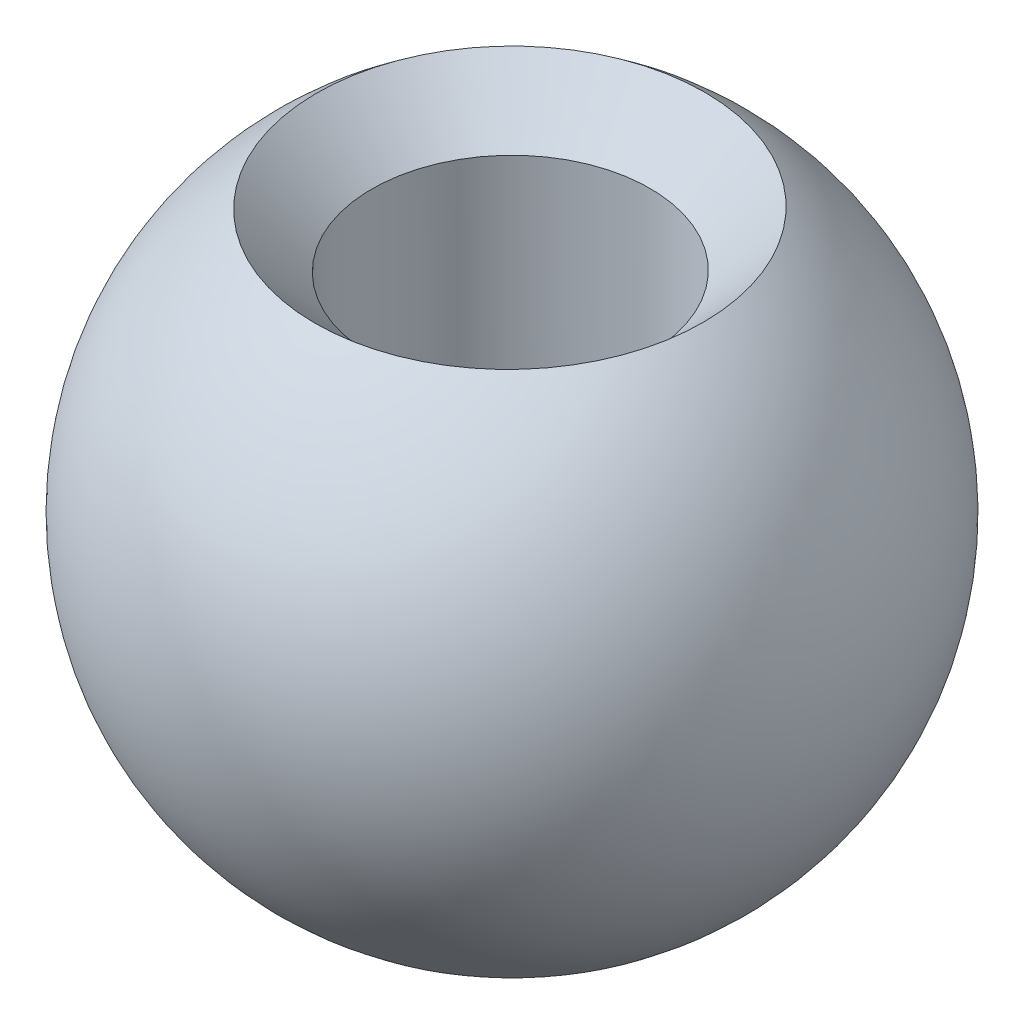
ISO-10303-21;
HEADER;
FILE_DESCRIPTION(('STEP AP214'),'2;1');
FILE_NAME('part.step','',(''),(''),'','','');
FILE_SCHEMA(('AUTOMOTIVE_DESIGN { 1 0 10303 214 1 1 1 1 }'));
ENDSEC;
DATA;
#1=APPLICATION_CONTEXT('core data for automotive mechanical design processes');
#2=APPLICATION_PROTOCOL_DEFINITION('international standard','automotive_design',2000,#1);
#3=PRODUCT_CONTEXT('',#1,'mechanical');
#4=PRODUCT('Part','Part','',(#3));
#5=PRODUCT_RELATED_PRODUCT_CATEGORY('part','',(#4));
#6=PRODUCT_DEFINITION_FORMATION('','',#4);
#7=PRODUCT_DEFINITION_CONTEXT('part definition',#1,'design');
#8=PRODUCT_DEFINITION('design','',#6,#7);
#9=PRODUCT_DEFINITION_SHAPE('','',#8);
#10=(LENGTH_UNIT() NAMED_UNIT(*) SI_UNIT(.MILLI.,.METRE.));
#11=(NAMED_UNIT(*) PLANE_ANGLE_UNIT() SI_UNIT($,.RADIAN.));
#12=(NAMED_UNIT(*) SI_UNIT($,.STERADIAN.) SOLID_ANGLE_UNIT());
#13=UNCERTAINTY_MEASURE_WITH_UNIT(LENGTH_MEASURE(1.E-05),#10,'distance_accuracy_value','');
#14=(GEOMETRIC_REPRESENTATION_CONTEXT(3) GLOBAL_UNCERTAINTY_ASSIGNED_CONTEXT((#13)) GLOBAL_UNIT_ASSIGNED_CONTEXT((#10,
#11,#12)) REPRESENTATION_CONTEXT('',''));
#15=CARTESIAN_POINT('',(0.,0.,0.));
#16=DIRECTION('',(0.,0.,1.));
#17=DIRECTION('',(1.,0.,0.));
#18=AXIS2_PLACEMENT_3D('',#15,#16,#17);
#19=CARTESIAN_POINT('',(0.,0.,0.));
#20=DIRECTION('',(1.,0.,0.));
#21=DIRECTION('',(0.,0.,-1.));
#22=AXIS2_PLACEMENT_3D('',#19,#20,#21);
#23=SPHERICAL_SURFACE('',#22,4.);
#24=CARTESIAN_POINT('',(0.,0.,0.));
#25=DIRECTION('',(0.00288793752712237,0.999935836072458,0.0109537005123799));
#26=DIRECTION('',(0.,-0.0109537461905999,0.999940005922551));
#27=AXIS2_PLACEMENT_3D('',#24,#25,#26);
#28=SPHERICAL_SURFACE('',#27,4.);
#29=CARTESIAN_POINT('',(-0.0104565673734244,-3.62054107500438,-0.0396608674253906));
#30=DIRECTION('',(0.00288793752712237,0.999935836072458,0.0109537005123799));
#31=DIRECTION('',(0.,-0.0109537461905999,0.999940005922551));
#32=AXIS2_PLACEMENT_3D('',#29,#30,#31);
#33=CIRCLE('',#32,1.69999999999999);
#34=CARTESIAN_POINT('',(-0.0104565673734244,-3.6391624435284,1.66023714264294));
#35=VERTEX_POINT('',#34);
#36=EDGE_CURVE('E10',#35,#35,#33,.F.);
#37=ORIENTED_EDGE('',*,*,#36,.F.);
#38=EDGE_LOOP('',(#37));
#39=FACE_BOUND('',#38,.T.);
#40=CARTESIAN_POINT('',(0.00930295514331486,3.22110784662446,0.0352853147143788));
#41=DIRECTION('',(-0.00288793752712237,-0.999935836072458,-0.0109537005123799));
#42=DIRECTION('',(0.,0.0109537461905999,-0.999940005922551));
#43=AXIS2_PLACEMENT_3D('',#40,#41,#42);
#44=CIRCLE('',#43,2.37131453881712);
#45=CARTESIAN_POINT('',(0.00930295514331486,3.24708262422074,-2.33588695927464));
#46=VERTEX_POINT('',#45);
#47=EDGE_CURVE('E41',#46,#46,#44,.F.);
#48=ORIENTED_EDGE('',*,*,#47,.F.);
#49=EDGE_LOOP('',(#48));
#50=FACE_BOUND('',#49,.T.);
#51=ADVANCED_FACE('F35',(#39,#50),#28,.T.);
#52=CARTESIAN_POINT('',(0.0115517501084895,3.99974334428983,0.0438148020495205));
#53=DIRECTION('',(0.00288793752712237,0.999935836072458,0.0109537005123799));
#54=DIRECTION('',(0.,-0.0109537461905999,0.999940005922551));
#55=AXIS2_PLACEMENT_3D('',#52,#53,#54);
#56=CYLINDRICAL_SURFACE('',#55,1.69999999999999);
#57=ORIENTED_EDGE('',*,*,#36,.T.);
#58=EDGE_LOOP('',(#57));
#59=FACE_BOUND('',#58,.T.);
#60=CARTESIAN_POINT('',(0.00736424069416202,2.54983638198476,0.0279319363065696));
#61=DIRECTION('',(0.00288793752712237,0.999935836072458,0.0109537005123799));
#62=DIRECTION('',(0.,-0.0109537461905999,0.999940005922551));
#63=AXIS2_PLACEMENT_3D('',#60,#61,#62);
#64=CIRCLE('',#63,1.69999999999999);
#65=CARTESIAN_POINT('',(0.00736424069416202,2.53121501346074,1.72782994637489));
#66=VERTEX_POINT('',#65);
#67=EDGE_CURVE('E45',#66,#66,#64,.T.);
#68=ORIENTED_EDGE('',*,*,#67,.T.);
#69=EDGE_LOOP('',(#68));
#70=FACE_BOUND('',#69,.T.);
#71=ADVANCED_FACE('F52',(#59,#70),#56,.F.);
#72=CARTESIAN_POINT('',(0.0115517501084895,3.99974334428983,0.0438148020495205));
#73=DIRECTION('',(0.00288793752712237,0.999935836072458,0.0109537005123799));
#74=DIRECTION('',(0.,-0.0109537461905999,0.999940005922551));
#75=AXIS2_PLACEMENT_3D('',#72,#73,#74);
#76=CONICAL_SURFACE('',#75,3.15,0.785398163397449);
#77=ORIENTED_EDGE('',*,*,#47,.T.);
#78=EDGE_LOOP('',(#77));
#79=FACE_BOUND('',#78,.T.);
#80=ORIENTED_EDGE('',*,*,#67,.F.);
#81=EDGE_LOOP('',(#80));
#82=FACE_BOUND('',#81,.T.);
#83=ADVANCED_FACE('F54',(#79,#82),#76,.F.);
#84=CLOSED_SHELL('',(#51,#71,#83));
#85=MANIFOLD_SOLID_BREP('B2',#84);
#86=ADVANCED_BREP_SHAPE_REPRESENTATION('',(#18,#85),#14);
#87=SHAPE_DEFINITION_REPRESENTATION(#9,#86);
ENDSEC;
END-ISO-10303-21;
